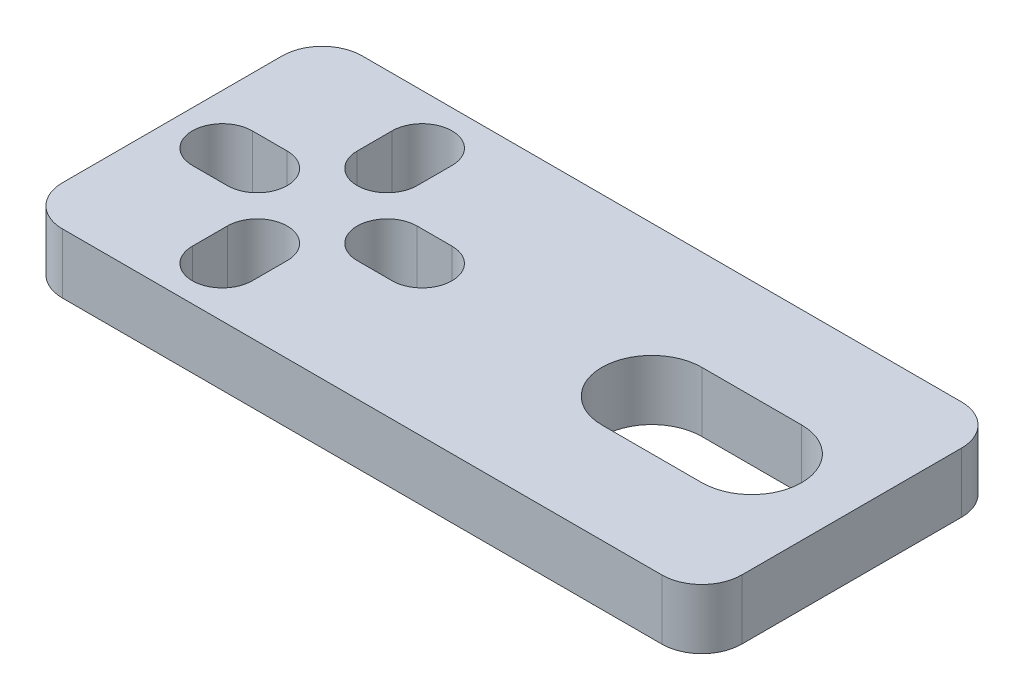
ISO-10303-21;
HEADER;
FILE_DESCRIPTION(('STEP AP214'),'2;1');
FILE_NAME('part.step','',(''),(''),'','','');
FILE_SCHEMA(('AUTOMOTIVE_DESIGN { 1 0 10303 214 1 1 1 1 }'));
ENDSEC;
DATA;
#1=APPLICATION_CONTEXT('core data for automotive mechanical design processes');
#2=APPLICATION_PROTOCOL_DEFINITION('international standard','automotive_design',2000,#1);
#3=PRODUCT_CONTEXT('',#1,'mechanical');
#4=PRODUCT('Part','Part','',(#3));
#5=PRODUCT_RELATED_PRODUCT_CATEGORY('part','',(#4));
#6=PRODUCT_DEFINITION_FORMATION('','',#4);
#7=PRODUCT_DEFINITION_CONTEXT('part definition',#1,'design');
#8=PRODUCT_DEFINITION('design','',#6,#7);
#9=PRODUCT_DEFINITION_SHAPE('','',#8);
#10=(LENGTH_UNIT() NAMED_UNIT(*) SI_UNIT(.MILLI.,.METRE.));
#11=(NAMED_UNIT(*) PLANE_ANGLE_UNIT() SI_UNIT($,.RADIAN.));
#12=(NAMED_UNIT(*) SI_UNIT($,.STERADIAN.) SOLID_ANGLE_UNIT());
#13=UNCERTAINTY_MEASURE_WITH_UNIT(LENGTH_MEASURE(1.E-05),#10,'distance_accuracy_value','');
#14=(GEOMETRIC_REPRESENTATION_CONTEXT(3) GLOBAL_UNCERTAINTY_ASSIGNED_CONTEXT((#13)) GLOBAL_UNIT_ASSIGNED_CONTEXT((#10,
#11,#12)) REPRESENTATION_CONTEXT('',''));
#15=CARTESIAN_POINT('',(0.,0.,0.));
#16=DIRECTION('',(0.,0.,1.));
#17=DIRECTION('',(1.,0.,0.));
#18=AXIS2_PLACEMENT_3D('',#15,#16,#17);
#19=CARTESIAN_POINT('',(12.5830679286446,4.74958475249559,4.66787542451857));
#20=DIRECTION('',(0.,-1.,0.));
#21=DIRECTION('',(0.,0.,-1.));
#22=AXIS2_PLACEMENT_3D('',#19,#20,#21);
#23=CYLINDRICAL_SURFACE('',#22,2.);
#24=CARTESIAN_POINT('',(12.5830679286446,1.74958475249559,4.66787542451857));
#25=DIRECTION('',(0.,1.,0.));
#26=DIRECTION('',(0.,0.,1.));
#27=AXIS2_PLACEMENT_3D('',#24,#25,#26);
#28=CIRCLE('',#27,2.);
#29=CARTESIAN_POINT('',(12.5830679286446,1.74958475249559,6.66787542451857));
#30=VERTEX_POINT('',#29);
#31=CARTESIAN_POINT('',(14.5830679286446,1.74958475249559,4.66787542451856));
#32=VERTEX_POINT('',#31);
#33=EDGE_CURVE('E358',#30,#32,#28,.T.);
#34=ORIENTED_EDGE('',*,*,#33,.T.);
#35=DIRECTION('',(0.,-1.,0.));
#36=VECTOR('',#35,1.);
#37=CARTESIAN_POINT('',(14.5830679286446,4.74958475249559,4.66787542451856));
#38=LINE('',#37,#36);
#39=CARTESIAN_POINT('',(14.5830679286446,4.74958475249559,4.66787542451856));
#40=VERTEX_POINT('',#39);
#41=EDGE_CURVE('E10',#40,#32,#38,.T.);
#42=ORIENTED_EDGE('',*,*,#41,.F.);
#43=CARTESIAN_POINT('',(12.5830679286446,4.74958475249559,4.66787542451857));
#44=DIRECTION('',(0.,1.,0.));
#45=DIRECTION('',(0.,0.,1.));
#46=AXIS2_PLACEMENT_3D('',#43,#44,#45);
#47=CIRCLE('',#46,2.);
#48=CARTESIAN_POINT('',(12.5830679286446,4.74958475249559,6.66787542451857));
#49=VERTEX_POINT('',#48);
#50=EDGE_CURVE('E365',#49,#40,#47,.T.);
#51=ORIENTED_EDGE('',*,*,#50,.F.);
#52=DIRECTION('',(0.,-1.,0.));
#53=VECTOR('',#52,1.);
#54=CARTESIAN_POINT('',(12.5830679286446,4.74958475249559,6.66787542451857));
#55=LINE('',#54,#53);
#56=EDGE_CURVE('E383',#49,#30,#55,.T.);
#57=ORIENTED_EDGE('',*,*,#56,.T.);
#58=EDGE_LOOP('',(#34,#42,#51,#57));
#59=FACE_BOUND('',#58,.T.);
#60=ADVANCED_FACE('F16',(#59),#23,.T.);
#61=CARTESIAN_POINT('',(14.5830679286446,4.74958475249559,-6.33212457548142));
#62=DIRECTION('',(-1.,0.,0.));
#63=DIRECTION('',(0.,0.,1.));
#64=AXIS2_PLACEMENT_3D('',#61,#62,#63);
#65=PLANE('',#64);
#66=DIRECTION('',(0.,0.,-1.));
#67=VECTOR('',#66,1.);
#68=CARTESIAN_POINT('',(14.5830679286446,1.74958475249559,-6.33212457548142));
#69=LINE('',#68,#67);
#70=CARTESIAN_POINT('',(14.5830679286446,1.74958475249559,-6.33212457548142));
#71=VERTEX_POINT('',#70);
#72=EDGE_CURVE('E386',#32,#71,#69,.T.);
#73=ORIENTED_EDGE('',*,*,#72,.T.);
#74=DIRECTION('',(0.,-1.,0.));
#75=VECTOR('',#74,1.);
#76=CARTESIAN_POINT('',(14.5830679286446,4.74958475249559,-6.33212457548142));
#77=LINE('',#76,#75);
#78=CARTESIAN_POINT('',(14.5830679286446,4.74958475249559,-6.33212457548142));
#79=VERTEX_POINT('',#78);
#80=EDGE_CURVE('E23',#79,#71,#77,.T.);
#81=ORIENTED_EDGE('',*,*,#80,.F.);
#82=DIRECTION('',(0.,0.,-1.));
#83=VECTOR('',#82,1.);
#84=CARTESIAN_POINT('',(14.5830679286446,4.74958475249559,-6.33212457548142));
#85=LINE('',#84,#83);
#86=EDGE_CURVE('E368',#40,#79,#85,.T.);
#87=ORIENTED_EDGE('',*,*,#86,.F.);
#88=ORIENTED_EDGE('',*,*,#41,.T.);
#89=EDGE_LOOP('',(#73,#81,#87,#88));
#90=FACE_BOUND('',#89,.T.);
#91=ADVANCED_FACE('F442',(#90),#65,.F.);
#92=CARTESIAN_POINT('',(12.5830679286446,4.74958475249559,-6.33212457548143));
#93=DIRECTION('',(0.,-1.,0.));
#94=DIRECTION('',(0.,0.,-1.));
#95=AXIS2_PLACEMENT_3D('',#92,#93,#94);
#96=CYLINDRICAL_SURFACE('',#95,2.);
#97=CARTESIAN_POINT('',(12.5830679286446,1.74958475249559,-6.33212457548143));
#98=DIRECTION('',(0.,1.,0.));
#99=DIRECTION('',(0.,0.,-1.));
#100=AXIS2_PLACEMENT_3D('',#97,#98,#99);
#101=CIRCLE('',#100,2.);
#102=CARTESIAN_POINT('',(12.5830679286446,1.74958475249559,-8.33212457548143));
#103=VERTEX_POINT('',#102);
#104=EDGE_CURVE('E388',#71,#103,#101,.T.);
#105=ORIENTED_EDGE('',*,*,#104,.T.);
#106=DIRECTION('',(0.,-1.,0.));
#107=VECTOR('',#106,1.);
#108=CARTESIAN_POINT('',(12.5830679286446,4.74958475249559,-8.33212457548143));
#109=LINE('',#108,#107);
#110=CARTESIAN_POINT('',(12.5830679286446,4.74958475249559,-8.33212457548143));
#111=VERTEX_POINT('',#110);
#112=EDGE_CURVE('E413',#111,#103,#109,.T.);
#113=ORIENTED_EDGE('',*,*,#112,.F.);
#114=CARTESIAN_POINT('',(12.5830679286446,4.74958475249559,-6.33212457548143));
#115=DIRECTION('',(0.,1.,0.));
#116=DIRECTION('',(0.,0.,-1.));
#117=AXIS2_PLACEMENT_3D('',#114,#115,#116);
#118=CIRCLE('',#117,2.);
#119=EDGE_CURVE('E371',#79,#111,#118,.T.);
#120=ORIENTED_EDGE('',*,*,#119,.F.);
#121=ORIENTED_EDGE('',*,*,#80,.T.);
#122=EDGE_LOOP('',(#105,#113,#120,#121));
#123=FACE_BOUND('',#122,.T.);
#124=ADVANCED_FACE('F420',(#123),#96,.T.);
#125=CARTESIAN_POINT('',(-17.4169320713554,4.74958475249559,-8.33212457548143));
#126=DIRECTION('',(0.,0.,1.));
#127=DIRECTION('',(1.,0.,0.));
#128=AXIS2_PLACEMENT_3D('',#125,#126,#127);
#129=PLANE('',#128);
#130=DIRECTION('',(-1.,0.,0.));
#131=VECTOR('',#130,1.);
#132=CARTESIAN_POINT('',(-17.4169320713554,1.74958475249559,-8.33212457548143));
#133=LINE('',#132,#131);
#134=CARTESIAN_POINT('',(-17.4169320713554,1.74958475249559,-8.33212457548143));
#135=VERTEX_POINT('',#134);
#136=EDGE_CURVE('E390',#103,#135,#133,.T.);
#137=ORIENTED_EDGE('',*,*,#136,.T.);
#138=DIRECTION('',(0.,-1.,0.));
#139=VECTOR('',#138,1.);
#140=CARTESIAN_POINT('',(-17.4169320713554,4.74958475249559,-8.33212457548143));
#141=LINE('',#140,#139);
#142=CARTESIAN_POINT('',(-17.4169320713554,4.74958475249559,-8.33212457548143));
#143=VERTEX_POINT('',#142);
#144=EDGE_CURVE('E410',#143,#135,#141,.T.);
#145=ORIENTED_EDGE('',*,*,#144,.F.);
#146=DIRECTION('',(-1.,0.,0.));
#147=VECTOR('',#146,1.);
#148=CARTESIAN_POINT('',(-17.4169320713554,4.74958475249559,-8.33212457548143));
#149=LINE('',#148,#147);
#150=EDGE_CURVE('E373',#111,#143,#149,.T.);
#151=ORIENTED_EDGE('',*,*,#150,.F.);
#152=ORIENTED_EDGE('',*,*,#112,.T.);
#153=EDGE_LOOP('',(#137,#145,#151,#152));
#154=FACE_BOUND('',#153,.T.);
#155=ADVANCED_FACE('F430',(#154),#129,.F.);
#156=CARTESIAN_POINT('',(-17.4169320713554,4.74958475249559,-6.33212457548143));
#157=DIRECTION('',(0.,-1.,0.));
#158=DIRECTION('',(0.,0.,-1.));
#159=AXIS2_PLACEMENT_3D('',#156,#157,#158);
#160=CYLINDRICAL_SURFACE('',#159,2.);
#161=CARTESIAN_POINT('',(-17.4169320713554,1.74958475249559,-6.33212457548143));
#162=DIRECTION('',(0.,1.,0.));
#163=DIRECTION('',(0.,0.,1.));
#164=AXIS2_PLACEMENT_3D('',#161,#162,#163);
#165=CIRCLE('',#164,2.);
#166=CARTESIAN_POINT('',(-19.4169320713554,1.74958475249559,-6.33212457548142));
#167=VERTEX_POINT('',#166);
#168=EDGE_CURVE('E392',#135,#167,#165,.T.);
#169=ORIENTED_EDGE('',*,*,#168,.T.);
#170=DIRECTION('',(0.,-1.,0.));
#171=VECTOR('',#170,1.);
#172=CARTESIAN_POINT('',(-19.4169320713554,4.74958475249559,-6.33212457548142));
#173=LINE('',#172,#171);
#174=CARTESIAN_POINT('',(-19.4169320713554,4.74958475249559,-6.33212457548142));
#175=VERTEX_POINT('',#174);
#176=EDGE_CURVE('E407',#175,#167,#173,.T.);
#177=ORIENTED_EDGE('',*,*,#176,.F.);
#178=CARTESIAN_POINT('',(-17.4169320713554,4.74958475249559,-6.33212457548143));
#179=DIRECTION('',(0.,1.,0.));
#180=DIRECTION('',(0.,0.,1.));
#181=AXIS2_PLACEMENT_3D('',#178,#179,#180);
#182=CIRCLE('',#181,2.);
#183=EDGE_CURVE('E375',#143,#175,#182,.T.);
#184=ORIENTED_EDGE('',*,*,#183,.F.);
#185=ORIENTED_EDGE('',*,*,#144,.T.);
#186=EDGE_LOOP('',(#169,#177,#184,#185));
#187=FACE_BOUND('',#186,.T.);
#188=ADVANCED_FACE('F434',(#187),#160,.T.);
#189=CARTESIAN_POINT('',(-19.4169320713554,4.74958475249559,-6.33212457548142));
#190=DIRECTION('',(1.,0.,0.));
#191=DIRECTION('',(0.,0.,-1.));
#192=AXIS2_PLACEMENT_3D('',#189,#190,#191);
#193=PLANE('',#192);
#194=DIRECTION('',(0.,0.,1.));
#195=VECTOR('',#194,1.);
#196=CARTESIAN_POINT('',(-19.4169320713554,1.74958475249559,-6.33212457548142));
#197=LINE('',#196,#195);
#198=CARTESIAN_POINT('',(-19.4169320713554,1.74958475249559,4.66787542451855));
#199=VERTEX_POINT('',#198);
#200=EDGE_CURVE('E394',#167,#199,#197,.T.);
#201=ORIENTED_EDGE('',*,*,#200,.T.);
#202=DIRECTION('',(0.,-1.,0.));
#203=VECTOR('',#202,1.);
#204=CARTESIAN_POINT('',(-19.4169320713554,4.74958475249559,4.66787542451855));
#205=LINE('',#204,#203);
#206=CARTESIAN_POINT('',(-19.4169320713554,4.74958475249559,4.66787542451855));
#207=VERTEX_POINT('',#206);
#208=EDGE_CURVE('E404',#207,#199,#205,.T.);
#209=ORIENTED_EDGE('',*,*,#208,.F.);
#210=DIRECTION('',(0.,0.,1.));
#211=VECTOR('',#210,1.);
#212=CARTESIAN_POINT('',(-19.4169320713554,4.74958475249559,-6.33212457548142));
#213=LINE('',#212,#211);
#214=EDGE_CURVE('E377',#175,#207,#213,.T.);
#215=ORIENTED_EDGE('',*,*,#214,.F.);
#216=ORIENTED_EDGE('',*,*,#176,.T.);
#217=EDGE_LOOP('',(#201,#209,#215,#216));
#218=FACE_BOUND('',#217,.T.);
#219=ADVANCED_FACE('F455',(#218),#193,.F.);
#220=CARTESIAN_POINT('',(-17.4169320713554,4.74958475249559,4.66787542451857));
#221=DIRECTION('',(0.,-1.,0.));
#222=DIRECTION('',(0.,0.,-1.));
#223=AXIS2_PLACEMENT_3D('',#220,#221,#222);
#224=CYLINDRICAL_SURFACE('',#223,2.);
#225=CARTESIAN_POINT('',(-17.4169320713554,1.74958475249559,4.66787542451857));
#226=DIRECTION('',(0.,1.,0.));
#227=DIRECTION('',(0.,0.,1.));
#228=AXIS2_PLACEMENT_3D('',#225,#226,#227);
#229=CIRCLE('',#228,2.);
#230=CARTESIAN_POINT('',(-17.4169320713554,1.74958475249559,6.66787542451857));
#231=VERTEX_POINT('',#230);
#232=EDGE_CURVE('E396',#199,#231,#229,.T.);
#233=ORIENTED_EDGE('',*,*,#232,.T.);
#234=DIRECTION('',(0.,-1.,0.));
#235=VECTOR('',#234,1.);
#236=CARTESIAN_POINT('',(-17.4169320713554,4.74958475249559,6.66787542451857));
#237=LINE('',#236,#235);
#238=CARTESIAN_POINT('',(-17.4169320713554,4.74958475249559,6.66787542451857));
#239=VERTEX_POINT('',#238);
#240=EDGE_CURVE('E401',#239,#231,#237,.T.);
#241=ORIENTED_EDGE('',*,*,#240,.F.);
#242=CARTESIAN_POINT('',(-17.4169320713554,4.74958475249559,4.66787542451857));
#243=DIRECTION('',(0.,1.,0.));
#244=DIRECTION('',(0.,0.,1.));
#245=AXIS2_PLACEMENT_3D('',#242,#243,#244);
#246=CIRCLE('',#245,2.);
#247=EDGE_CURVE('E379',#207,#239,#246,.T.);
#248=ORIENTED_EDGE('',*,*,#247,.F.);
#249=ORIENTED_EDGE('',*,*,#208,.T.);
#250=EDGE_LOOP('',(#233,#241,#248,#249));
#251=FACE_BOUND('',#250,.T.);
#252=ADVANCED_FACE('F453',(#251),#224,.T.);
#253=CARTESIAN_POINT('',(-17.4169320713554,4.74958475249559,6.66787542451857));
#254=DIRECTION('',(0.,0.,-1.));
#255=DIRECTION('',(-1.,0.,0.));
#256=AXIS2_PLACEMENT_3D('',#253,#254,#255);
#257=PLANE('',#256);
#258=DIRECTION('',(1.,0.,0.));
#259=VECTOR('',#258,1.);
#260=CARTESIAN_POINT('',(-17.4169320713554,1.74958475249559,6.66787542451857));
#261=LINE('',#260,#259);
#262=EDGE_CURVE('E369',#231,#30,#261,.T.);
#263=ORIENTED_EDGE('',*,*,#262,.T.);
#264=ORIENTED_EDGE('',*,*,#56,.F.);
#265=DIRECTION('',(1.,0.,0.));
#266=VECTOR('',#265,1.);
#267=CARTESIAN_POINT('',(-17.4169320713554,4.74958475249559,6.66787542451857));
#268=LINE('',#267,#266);
#269=EDGE_CURVE('E381',#239,#49,#268,.T.);
#270=ORIENTED_EDGE('',*,*,#269,.F.);
#271=ORIENTED_EDGE('',*,*,#240,.T.);
#272=EDGE_LOOP('',(#263,#264,#270,#271));
#273=FACE_BOUND('',#272,.T.);
#274=ADVANCED_FACE('F448',(#273),#257,.F.);
#275=CARTESIAN_POINT('',(12.5830679286446,4.74958475249559,4.66787542451857));
#276=DIRECTION('',(0.,1.,0.));
#277=DIRECTION('',(0.,0.,1.));
#278=AXIS2_PLACEMENT_3D('',#275,#276,#277);
#279=PLANE('',#278);
#280=CARTESIAN_POINT('',(-11.9169320713554,4.74958475249559,2.41787542451857));
#281=DIRECTION('',(0.,1.,0.));
#282=DIRECTION('',(0.,0.,1.));
#283=AXIS2_PLACEMENT_3D('',#280,#281,#282);
#284=CIRCLE('',#283,1.5);
#285=CARTESIAN_POINT('',(-10.4169320713554,4.74958475249559,2.41787542451857));
#286=VERTEX_POINT('',#285);
#287=CARTESIAN_POINT('',(-13.4169320713554,4.74958475249559,2.41787542451857));
#288=VERTEX_POINT('',#287);
#289=EDGE_CURVE('E30',#286,#288,#284,.T.);
#290=ORIENTED_EDGE('',*,*,#289,.F.);
#291=DIRECTION('',(0.,0.,-1.));
#292=VECTOR('',#291,1.);
#293=CARTESIAN_POINT('',(-10.4169320713554,4.74958475249559,2.41787542451857));
#294=LINE('',#293,#292);
#295=CARTESIAN_POINT('',(-10.4169320713554,4.74958475249559,4.16787542451857));
#296=VERTEX_POINT('',#295);
#297=EDGE_CURVE('E218',#296,#286,#294,.T.);
#298=ORIENTED_EDGE('',*,*,#297,.F.);
#299=CARTESIAN_POINT('',(-11.9169320713554,4.74958475249559,4.16787542451857));
#300=DIRECTION('',(0.,1.,0.));
#301=DIRECTION('',(0.,0.,1.));
#302=AXIS2_PLACEMENT_3D('',#299,#300,#301);
#303=CIRCLE('',#302,1.5);
#304=CARTESIAN_POINT('',(-13.4169320713554,4.74958475249559,4.16787542451857));
#305=VERTEX_POINT('',#304);
#306=EDGE_CURVE('E221',#305,#296,#303,.T.);
#307=ORIENTED_EDGE('',*,*,#306,.F.);
#308=DIRECTION('',(0.,0.,1.));
#309=VECTOR('',#308,1.);
#310=CARTESIAN_POINT('',(-13.4169320713554,4.74958475249559,2.41787542451857));
#311=LINE('',#310,#309);
#312=EDGE_CURVE('E227',#288,#305,#311,.T.);
#313=ORIENTED_EDGE('',*,*,#312,.F.);
#314=EDGE_LOOP('',(#290,#298,#307,#313));
#315=FACE_BOUND('',#314,.T.);
#316=CARTESIAN_POINT('',(-11.9169320713554,4.74958475249559,-5.83212457548143));
#317=DIRECTION('',(0.,1.,0.));
#318=DIRECTION('',(0.,0.,1.));
#319=AXIS2_PLACEMENT_3D('',#316,#317,#318);
#320=CIRCLE('',#319,1.5);
#321=CARTESIAN_POINT('',(-10.4169320713554,4.74958475249559,-5.83212457548143));
#322=VERTEX_POINT('',#321);
#323=CARTESIAN_POINT('',(-13.4169320713554,4.74958475249559,-5.83212457548143));
#324=VERTEX_POINT('',#323);
#325=EDGE_CURVE('E233',#322,#324,#320,.T.);
#326=ORIENTED_EDGE('',*,*,#325,.F.);
#327=DIRECTION('',(0.,0.,-1.));
#328=VECTOR('',#327,1.);
#329=CARTESIAN_POINT('',(-10.4169320713554,4.74958475249559,-5.83212457548143));
#330=LINE('',#329,#328);
#331=CARTESIAN_POINT('',(-10.4169320713554,4.74958475249559,-4.08212457548143));
#332=VERTEX_POINT('',#331);
#333=EDGE_CURVE('E241',#332,#322,#330,.T.);
#334=ORIENTED_EDGE('',*,*,#333,.F.);
#335=CARTESIAN_POINT('',(-11.9169320713554,4.74958475249559,-4.08212457548143));
#336=DIRECTION('',(0.,1.,0.));
#337=DIRECTION('',(0.,0.,1.));
#338=AXIS2_PLACEMENT_3D('',#335,#336,#337);
#339=CIRCLE('',#338,1.5);
#340=CARTESIAN_POINT('',(-13.4169320713554,4.74958475249559,-4.08212457548143));
#341=VERTEX_POINT('',#340);
#342=EDGE_CURVE('E255',#341,#332,#339,.T.);
#343=ORIENTED_EDGE('',*,*,#342,.F.);
#344=DIRECTION('',(0.,0.,1.));
#345=VECTOR('',#344,1.);
#346=CARTESIAN_POINT('',(-13.4169320713554,4.74958475249559,-5.83212457548143));
#347=LINE('',#346,#345);
#348=EDGE_CURVE('E252',#324,#341,#347,.T.);
#349=ORIENTED_EDGE('',*,*,#348,.F.);
#350=EDGE_LOOP('',(#326,#334,#343,#349));
#351=FACE_BOUND('',#350,.T.);
#352=CARTESIAN_POINT('',(-8.66693207135541,4.74958475249559,-0.83212457548143));
#353=DIRECTION('',(0.,1.,0.));
#354=DIRECTION('',(0.,0.,1.));
#355=AXIS2_PLACEMENT_3D('',#352,#353,#354);
#356=CIRCLE('',#355,1.5);
#357=CARTESIAN_POINT('',(-8.66693207135541,4.74958475249559,-2.33212457548143));
#358=VERTEX_POINT('',#357);
#359=CARTESIAN_POINT('',(-8.66693207135541,4.74958475249559,0.66787542451857));
#360=VERTEX_POINT('',#359);
#361=EDGE_CURVE('E262',#358,#360,#356,.T.);
#362=ORIENTED_EDGE('',*,*,#361,.F.);
#363=DIRECTION('',(-1.,0.,0.));
#364=VECTOR('',#363,1.);
#365=CARTESIAN_POINT('',(-8.66693207135541,4.74958475249559,-2.33212457548143));
#366=LINE('',#365,#364);
#367=CARTESIAN_POINT('',(-6.91693207135541,4.74958475249559,-2.33212457548143));
#368=VERTEX_POINT('',#367);
#369=EDGE_CURVE('E273',#368,#358,#366,.T.);
#370=ORIENTED_EDGE('',*,*,#369,.F.);
#371=CARTESIAN_POINT('',(-6.91693207135541,4.74958475249559,-0.83212457548143));
#372=DIRECTION('',(0.,1.,0.));
#373=DIRECTION('',(0.,0.,1.));
#374=AXIS2_PLACEMENT_3D('',#371,#372,#373);
#375=CIRCLE('',#374,1.5);
#376=CARTESIAN_POINT('',(-6.91693207135541,4.74958475249559,0.66787542451857));
#377=VERTEX_POINT('',#376);
#378=EDGE_CURVE('E287',#377,#368,#375,.T.);
#379=ORIENTED_EDGE('',*,*,#378,.F.);
#380=DIRECTION('',(1.,0.,0.));
#381=VECTOR('',#380,1.);
#382=CARTESIAN_POINT('',(-8.66693207135541,4.74958475249559,0.66787542451857));
#383=LINE('',#382,#381);
#384=EDGE_CURVE('E284',#360,#377,#383,.T.);
#385=ORIENTED_EDGE('',*,*,#384,.F.);
#386=EDGE_LOOP('',(#362,#370,#379,#385));
#387=FACE_BOUND('',#386,.T.);
#388=CARTESIAN_POINT('',(-16.9169320713554,4.74958475249559,-0.83212457548143));
#389=DIRECTION('',(0.,1.,0.));
#390=DIRECTION('',(0.,0.,1.));
#391=AXIS2_PLACEMENT_3D('',#388,#389,#390);
#392=CIRCLE('',#391,1.5);
#393=CARTESIAN_POINT('',(-16.9169320713554,4.74958475249559,-2.33212457548143));
#394=VERTEX_POINT('',#393);
#395=CARTESIAN_POINT('',(-16.9169320713554,4.74958475249559,0.66787542451857));
#396=VERTEX_POINT('',#395);
#397=EDGE_CURVE('E294',#394,#396,#392,.T.);
#398=ORIENTED_EDGE('',*,*,#397,.F.);
#399=DIRECTION('',(-1.,0.,0.));
#400=VECTOR('',#399,1.);
#401=CARTESIAN_POINT('',(-16.9169320713554,4.74958475249559,-2.33212457548143));
#402=LINE('',#401,#400);
#403=CARTESIAN_POINT('',(-15.1669320713554,4.74958475249559,-2.33212457548143));
#404=VERTEX_POINT('',#403);
#405=EDGE_CURVE('E305',#404,#394,#402,.T.);
#406=ORIENTED_EDGE('',*,*,#405,.F.);
#407=CARTESIAN_POINT('',(-15.1669320713554,4.74958475249559,-0.83212457548143));
#408=DIRECTION('',(0.,1.,0.));
#409=DIRECTION('',(0.,0.,1.));
#410=AXIS2_PLACEMENT_3D('',#407,#408,#409);
#411=CIRCLE('',#410,1.5);
#412=CARTESIAN_POINT('',(-15.1669320713554,4.74958475249559,0.66787542451857));
#413=VERTEX_POINT('',#412);
#414=EDGE_CURVE('E319',#413,#404,#411,.T.);
#415=ORIENTED_EDGE('',*,*,#414,.F.);
#416=DIRECTION('',(1.,0.,0.));
#417=VECTOR('',#416,1.);
#418=CARTESIAN_POINT('',(-16.9169320713554,4.74958475249559,0.66787542451857));
#419=LINE('',#418,#417);
#420=EDGE_CURVE('E316',#396,#413,#419,.T.);
#421=ORIENTED_EDGE('',*,*,#420,.F.);
#422=EDGE_LOOP('',(#398,#406,#415,#421));
#423=FACE_BOUND('',#422,.T.);
#424=CARTESIAN_POINT('',(4.5830679286446,4.74958475249559,-0.83212457548143));
#425=DIRECTION('',(0.,1.,0.));
#426=DIRECTION('',(0.,0.,1.));
#427=AXIS2_PLACEMENT_3D('',#424,#425,#426);
#428=CIRCLE('',#427,2.5);
#429=CARTESIAN_POINT('',(4.5830679286446,4.74958475249559,-3.33212457548143));
#430=VERTEX_POINT('',#429);
#431=CARTESIAN_POINT('',(4.5830679286446,4.74958475249559,1.66787542451857));
#432=VERTEX_POINT('',#431);
#433=EDGE_CURVE('E326',#430,#432,#428,.T.);
#434=ORIENTED_EDGE('',*,*,#433,.F.);
#435=DIRECTION('',(-1.,0.,0.));
#436=VECTOR('',#435,1.);
#437=CARTESIAN_POINT('',(4.5830679286446,4.74958475249559,-3.33212457548143));
#438=LINE('',#437,#436);
#439=CARTESIAN_POINT('',(9.5830679286446,4.74958475249559,-3.33212457548143));
#440=VERTEX_POINT('',#439);
#441=EDGE_CURVE('E337',#440,#430,#438,.T.);
#442=ORIENTED_EDGE('',*,*,#441,.F.);
#443=CARTESIAN_POINT('',(9.5830679286446,4.74958475249559,-0.83212457548143));
#444=DIRECTION('',(0.,1.,0.));
#445=DIRECTION('',(0.,0.,1.));
#446=AXIS2_PLACEMENT_3D('',#443,#444,#445);
#447=CIRCLE('',#446,2.5);
#448=CARTESIAN_POINT('',(9.5830679286446,4.74958475249559,1.66787542451857));
#449=VERTEX_POINT('',#448);
#450=EDGE_CURVE('E351',#449,#440,#447,.T.);
#451=ORIENTED_EDGE('',*,*,#450,.F.);
#452=DIRECTION('',(1.,0.,0.));
#453=VECTOR('',#452,1.);
#454=CARTESIAN_POINT('',(4.5830679286446,4.74958475249559,1.66787542451857));
#455=LINE('',#454,#453);
#456=EDGE_CURVE('E348',#432,#449,#455,.T.);
#457=ORIENTED_EDGE('',*,*,#456,.F.);
#458=EDGE_LOOP('',(#434,#442,#451,#457));
#459=FACE_BOUND('',#458,.T.);
#460=ORIENTED_EDGE('',*,*,#50,.T.);
#461=ORIENTED_EDGE('',*,*,#86,.T.);
#462=ORIENTED_EDGE('',*,*,#119,.T.);
#463=ORIENTED_EDGE('',*,*,#150,.T.);
#464=ORIENTED_EDGE('',*,*,#183,.T.);
#465=ORIENTED_EDGE('',*,*,#214,.T.);
#466=ORIENTED_EDGE('',*,*,#247,.T.);
#467=ORIENTED_EDGE('',*,*,#269,.T.);
#468=EDGE_LOOP('',(#460,#461,#462,#463,#464,#465,#466,#467));
#469=FACE_BOUND('',#468,.T.);
#470=ADVANCED_FACE('F438',(#315,#351,#387,#423,#459,#469),#279,.T.);
#471=CARTESIAN_POINT('',(12.5830679286446,1.74958475249559,4.66787542451857));
#472=DIRECTION('',(0.,1.,0.));
#473=DIRECTION('',(0.,0.,1.));
#474=AXIS2_PLACEMENT_3D('',#471,#472,#473);
#475=PLANE('',#474);
#476=DIRECTION('',(0.,0.,-1.));
#477=VECTOR('',#476,1.);
#478=CARTESIAN_POINT('',(-10.4169320713554,1.74958475249559,2.41787542451857));
#479=LINE('',#478,#477);
#480=CARTESIAN_POINT('',(-10.4169320713554,1.74958475249559,4.16787542451857));
#481=VERTEX_POINT('',#480);
#482=CARTESIAN_POINT('',(-10.4169320713554,1.74958475249559,2.41787542451857));
#483=VERTEX_POINT('',#482);
#484=EDGE_CURVE('E208',#481,#483,#479,.T.);
#485=ORIENTED_EDGE('',*,*,#484,.T.);
#486=CARTESIAN_POINT('',(-11.9169320713554,1.74958475249559,2.41787542451857));
#487=DIRECTION('',(0.,1.,0.));
#488=DIRECTION('',(0.,0.,1.));
#489=AXIS2_PLACEMENT_3D('',#486,#487,#488);
#490=CIRCLE('',#489,1.5);
#491=CARTESIAN_POINT('',(-13.4169320713554,1.74958475249559,2.41787542451857));
#492=VERTEX_POINT('',#491);
#493=EDGE_CURVE('E202',#483,#492,#490,.T.);
#494=ORIENTED_EDGE('',*,*,#493,.T.);
#495=DIRECTION('',(0.,0.,1.));
#496=VECTOR('',#495,1.);
#497=CARTESIAN_POINT('',(-13.4169320713554,1.74958475249559,2.41787542451857));
#498=LINE('',#497,#496);
#499=CARTESIAN_POINT('',(-13.4169320713554,1.74958475249559,4.16787542451857));
#500=VERTEX_POINT('',#499);
#501=EDGE_CURVE('E211',#492,#500,#498,.T.);
#502=ORIENTED_EDGE('',*,*,#501,.T.);
#503=CARTESIAN_POINT('',(-11.9169320713554,1.74958475249559,4.16787542451857));
#504=DIRECTION('',(0.,1.,0.));
#505=DIRECTION('',(0.,0.,1.));
#506=AXIS2_PLACEMENT_3D('',#503,#504,#505);
#507=CIRCLE('',#506,1.5);
#508=EDGE_CURVE('E38',#500,#481,#507,.T.);
#509=ORIENTED_EDGE('',*,*,#508,.T.);
#510=EDGE_LOOP('',(#485,#494,#502,#509));
#511=FACE_BOUND('',#510,.T.);
#512=DIRECTION('',(0.,0.,-1.));
#513=VECTOR('',#512,1.);
#514=CARTESIAN_POINT('',(-10.4169320713554,1.74958475249559,-5.83212457548143));
#515=LINE('',#514,#513);
#516=CARTESIAN_POINT('',(-10.4169320713554,1.74958475249559,-4.08212457548143));
#517=VERTEX_POINT('',#516);
#518=CARTESIAN_POINT('',(-10.4169320713554,1.74958475249559,-5.83212457548143));
#519=VERTEX_POINT('',#518);
#520=EDGE_CURVE('E247',#517,#519,#515,.T.);
#521=ORIENTED_EDGE('',*,*,#520,.T.);
#522=CARTESIAN_POINT('',(-11.9169320713554,1.74958475249559,-5.83212457548143));
#523=DIRECTION('',(0.,1.,0.));
#524=DIRECTION('',(0.,0.,1.));
#525=AXIS2_PLACEMENT_3D('',#522,#523,#524);
#526=CIRCLE('',#525,1.5);
#527=CARTESIAN_POINT('',(-13.4169320713554,1.74958475249559,-5.83212457548143));
#528=VERTEX_POINT('',#527);
#529=EDGE_CURVE('E237',#519,#528,#526,.T.);
#530=ORIENTED_EDGE('',*,*,#529,.T.);
#531=DIRECTION('',(0.,0.,1.));
#532=VECTOR('',#531,1.);
#533=CARTESIAN_POINT('',(-13.4169320713554,1.74958475249559,-5.83212457548143));
#534=LINE('',#533,#532);
#535=CARTESIAN_POINT('',(-13.4169320713554,1.74958475249559,-4.08212457548143));
#536=VERTEX_POINT('',#535);
#537=EDGE_CURVE('E240',#528,#536,#534,.T.);
#538=ORIENTED_EDGE('',*,*,#537,.T.);
#539=CARTESIAN_POINT('',(-11.9169320713554,1.74958475249559,-4.08212457548143));
#540=DIRECTION('',(0.,1.,0.));
#541=DIRECTION('',(0.,0.,1.));
#542=AXIS2_PLACEMENT_3D('',#539,#540,#541);
#543=CIRCLE('',#542,1.5);
#544=EDGE_CURVE('E244',#536,#517,#543,.T.);
#545=ORIENTED_EDGE('',*,*,#544,.T.);
#546=EDGE_LOOP('',(#521,#530,#538,#545));
#547=FACE_BOUND('',#546,.T.);
#548=DIRECTION('',(-1.,0.,0.));
#549=VECTOR('',#548,1.);
#550=CARTESIAN_POINT('',(-8.66693207135541,1.74958475249559,-2.33212457548143));
#551=LINE('',#550,#549);
#552=CARTESIAN_POINT('',(-6.91693207135541,1.74958475249559,-2.33212457548143));
#553=VERTEX_POINT('',#552);
#554=CARTESIAN_POINT('',(-8.66693207135541,1.74958475249559,-2.33212457548143));
#555=VERTEX_POINT('',#554);
#556=EDGE_CURVE('E279',#553,#555,#551,.T.);
#557=ORIENTED_EDGE('',*,*,#556,.T.);
#558=CARTESIAN_POINT('',(-8.66693207135541,1.74958475249559,-0.83212457548143));
#559=DIRECTION('',(0.,1.,0.));
#560=DIRECTION('',(0.,0.,1.));
#561=AXIS2_PLACEMENT_3D('',#558,#559,#560);
#562=CIRCLE('',#561,1.5);
#563=CARTESIAN_POINT('',(-8.66693207135541,1.74958475249559,0.66787542451857));
#564=VERTEX_POINT('',#563);
#565=EDGE_CURVE('E269',#555,#564,#562,.T.);
#566=ORIENTED_EDGE('',*,*,#565,.T.);
#567=DIRECTION('',(1.,0.,0.));
#568=VECTOR('',#567,1.);
#569=CARTESIAN_POINT('',(-8.66693207135541,1.74958475249559,0.66787542451857));
#570=LINE('',#569,#568);
#571=CARTESIAN_POINT('',(-6.91693207135541,1.74958475249559,0.66787542451857));
#572=VERTEX_POINT('',#571);
#573=EDGE_CURVE('E272',#564,#572,#570,.T.);
#574=ORIENTED_EDGE('',*,*,#573,.T.);
#575=CARTESIAN_POINT('',(-6.91693207135541,1.74958475249559,-0.83212457548143));
#576=DIRECTION('',(0.,1.,0.));
#577=DIRECTION('',(0.,0.,1.));
#578=AXIS2_PLACEMENT_3D('',#575,#576,#577);
#579=CIRCLE('',#578,1.5);
#580=EDGE_CURVE('E276',#572,#553,#579,.T.);
#581=ORIENTED_EDGE('',*,*,#580,.T.);
#582=EDGE_LOOP('',(#557,#566,#574,#581));
#583=FACE_BOUND('',#582,.T.);
#584=DIRECTION('',(-1.,0.,0.));
#585=VECTOR('',#584,1.);
#586=CARTESIAN_POINT('',(-16.9169320713554,1.74958475249559,-2.33212457548143));
#587=LINE('',#586,#585);
#588=CARTESIAN_POINT('',(-15.1669320713554,1.74958475249559,-2.33212457548143));
#589=VERTEX_POINT('',#588);
#590=CARTESIAN_POINT('',(-16.9169320713554,1.74958475249559,-2.33212457548143));
#591=VERTEX_POINT('',#590);
#592=EDGE_CURVE('E311',#589,#591,#587,.T.);
#593=ORIENTED_EDGE('',*,*,#592,.T.);
#594=CARTESIAN_POINT('',(-16.9169320713554,1.74958475249559,-0.83212457548143));
#595=DIRECTION('',(0.,1.,0.));
#596=DIRECTION('',(0.,0.,1.));
#597=AXIS2_PLACEMENT_3D('',#594,#595,#596);
#598=CIRCLE('',#597,1.5);
#599=CARTESIAN_POINT('',(-16.9169320713554,1.74958475249559,0.66787542451857));
#600=VERTEX_POINT('',#599);
#601=EDGE_CURVE('E301',#591,#600,#598,.T.);
#602=ORIENTED_EDGE('',*,*,#601,.T.);
#603=DIRECTION('',(1.,0.,0.));
#604=VECTOR('',#603,1.);
#605=CARTESIAN_POINT('',(-16.9169320713554,1.74958475249559,0.66787542451857));
#606=LINE('',#605,#604);
#607=CARTESIAN_POINT('',(-15.1669320713554,1.74958475249559,0.66787542451857));
#608=VERTEX_POINT('',#607);
#609=EDGE_CURVE('E304',#600,#608,#606,.T.);
#610=ORIENTED_EDGE('',*,*,#609,.T.);
#611=CARTESIAN_POINT('',(-15.1669320713554,1.74958475249559,-0.83212457548143));
#612=DIRECTION('',(0.,1.,0.));
#613=DIRECTION('',(0.,0.,1.));
#614=AXIS2_PLACEMENT_3D('',#611,#612,#613);
#615=CIRCLE('',#614,1.5);
#616=EDGE_CURVE('E308',#608,#589,#615,.T.);
#617=ORIENTED_EDGE('',*,*,#616,.T.);
#618=EDGE_LOOP('',(#593,#602,#610,#617));
#619=FACE_BOUND('',#618,.T.);
#620=DIRECTION('',(-1.,0.,0.));
#621=VECTOR('',#620,1.);
#622=CARTESIAN_POINT('',(4.5830679286446,1.74958475249559,-3.33212457548143));
#623=LINE('',#622,#621);
#624=CARTESIAN_POINT('',(9.5830679286446,1.74958475249559,-3.33212457548143));
#625=VERTEX_POINT('',#624);
#626=CARTESIAN_POINT('',(4.5830679286446,1.74958475249559,-3.33212457548143));
#627=VERTEX_POINT('',#626);
#628=EDGE_CURVE('E343',#625,#627,#623,.T.);
#629=ORIENTED_EDGE('',*,*,#628,.T.);
#630=CARTESIAN_POINT('',(4.5830679286446,1.74958475249559,-0.83212457548143));
#631=DIRECTION('',(0.,1.,0.));
#632=DIRECTION('',(0.,0.,1.));
#633=AXIS2_PLACEMENT_3D('',#630,#631,#632);
#634=CIRCLE('',#633,2.5);
#635=CARTESIAN_POINT('',(4.5830679286446,1.74958475249559,1.66787542451857));
#636=VERTEX_POINT('',#635);
#637=EDGE_CURVE('E333',#627,#636,#634,.T.);
#638=ORIENTED_EDGE('',*,*,#637,.T.);
#639=DIRECTION('',(1.,0.,0.));
#640=VECTOR('',#639,1.);
#641=CARTESIAN_POINT('',(4.5830679286446,1.74958475249559,1.66787542451857));
#642=LINE('',#641,#640);
#643=CARTESIAN_POINT('',(9.5830679286446,1.74958475249559,1.66787542451857));
#644=VERTEX_POINT('',#643);
#645=EDGE_CURVE('E336',#636,#644,#642,.T.);
#646=ORIENTED_EDGE('',*,*,#645,.T.);
#647=CARTESIAN_POINT('',(9.5830679286446,1.74958475249559,-0.83212457548143));
#648=DIRECTION('',(0.,1.,0.));
#649=DIRECTION('',(0.,0.,1.));
#650=AXIS2_PLACEMENT_3D('',#647,#648,#649);
#651=CIRCLE('',#650,2.5);
#652=EDGE_CURVE('E340',#644,#625,#651,.T.);
#653=ORIENTED_EDGE('',*,*,#652,.T.);
#654=EDGE_LOOP('',(#629,#638,#646,#653));
#655=FACE_BOUND('',#654,.T.);
#656=ORIENTED_EDGE('',*,*,#33,.F.);
#657=ORIENTED_EDGE('',*,*,#262,.F.);
#658=ORIENTED_EDGE('',*,*,#232,.F.);
#659=ORIENTED_EDGE('',*,*,#200,.F.);
#660=ORIENTED_EDGE('',*,*,#168,.F.);
#661=ORIENTED_EDGE('',*,*,#136,.F.);
#662=ORIENTED_EDGE('',*,*,#104,.F.);
#663=ORIENTED_EDGE('',*,*,#72,.F.);
#664=EDGE_LOOP('',(#656,#657,#658,#659,#660,#661,#662,#663));
#665=FACE_BOUND('',#664,.T.);
#666=ADVANCED_FACE('F215',(#511,#547,#583,#619,#655,#665),#475,.F.);
#667=CARTESIAN_POINT('',(4.5830679286446,1.74958475249559,-0.83212457548143));
#668=DIRECTION('',(0.,1.,0.));
#669=DIRECTION('',(0.,0.,1.));
#670=AXIS2_PLACEMENT_3D('',#667,#668,#669);
#671=CYLINDRICAL_SURFACE('',#670,2.5);
#672=ORIENTED_EDGE('',*,*,#433,.T.);
#673=DIRECTION('',(0.,1.,0.));
#674=VECTOR('',#673,1.);
#675=CARTESIAN_POINT('',(4.5830679286446,1.74958475249559,1.66787542451857));
#676=LINE('',#675,#674);
#677=EDGE_CURVE('E346',#636,#432,#676,.T.);
#678=ORIENTED_EDGE('',*,*,#677,.F.);
#679=ORIENTED_EDGE('',*,*,#637,.F.);
#680=DIRECTION('',(0.,1.,0.));
#681=VECTOR('',#680,1.);
#682=CARTESIAN_POINT('',(4.5830679286446,1.74958475249559,-3.33212457548143));
#683=LINE('',#682,#681);
#684=EDGE_CURVE('E356',#627,#430,#683,.T.);
#685=ORIENTED_EDGE('',*,*,#684,.T.);
#686=EDGE_LOOP('',(#672,#678,#679,#685));
#687=FACE_BOUND('',#686,.T.);
#688=ADVANCED_FACE('F524',(#687),#671,.F.);
#689=CARTESIAN_POINT('',(4.5830679286446,1.74958475249559,-3.33212457548143));
#690=DIRECTION('',(0.,0.,-1.));
#691=DIRECTION('',(-1.,0.,0.));
#692=AXIS2_PLACEMENT_3D('',#689,#690,#691);
#693=PLANE('',#692);
#694=ORIENTED_EDGE('',*,*,#441,.T.);
#695=ORIENTED_EDGE('',*,*,#684,.F.);
#696=ORIENTED_EDGE('',*,*,#628,.F.);
#697=DIRECTION('',(0.,1.,0.));
#698=VECTOR('',#697,1.);
#699=CARTESIAN_POINT('',(9.5830679286446,1.74958475249559,-3.33212457548143));
#700=LINE('',#699,#698);
#701=EDGE_CURVE('E359',#625,#440,#700,.T.);
#702=ORIENTED_EDGE('',*,*,#701,.T.);
#703=EDGE_LOOP('',(#694,#695,#696,#702));
#704=FACE_BOUND('',#703,.T.);
#705=ADVANCED_FACE('F533',(#704),#693,.F.);
#706=CARTESIAN_POINT('',(9.5830679286446,1.74958475249559,-0.83212457548143));
#707=DIRECTION('',(0.,1.,0.));
#708=DIRECTION('',(0.,0.,1.));
#709=AXIS2_PLACEMENT_3D('',#706,#707,#708);
#710=CYLINDRICAL_SURFACE('',#709,2.5);
#711=ORIENTED_EDGE('',*,*,#450,.T.);
#712=ORIENTED_EDGE('',*,*,#701,.F.);
#713=ORIENTED_EDGE('',*,*,#652,.F.);
#714=DIRECTION('',(0.,1.,0.));
#715=VECTOR('',#714,1.);
#716=CARTESIAN_POINT('',(9.5830679286446,1.74958475249559,1.66787542451857));
#717=LINE('',#716,#715);
#718=EDGE_CURVE('E361',#644,#449,#717,.T.);
#719=ORIENTED_EDGE('',*,*,#718,.T.);
#720=EDGE_LOOP('',(#711,#712,#713,#719));
#721=FACE_BOUND('',#720,.T.);
#722=ADVANCED_FACE('F543',(#721),#710,.F.);
#723=CARTESIAN_POINT('',(4.5830679286446,1.74958475249559,1.66787542451857));
#724=DIRECTION('',(0.,0.,1.));
#725=DIRECTION('',(1.,0.,0.));
#726=AXIS2_PLACEMENT_3D('',#723,#724,#725);
#727=PLANE('',#726);
#728=ORIENTED_EDGE('',*,*,#456,.T.);
#729=ORIENTED_EDGE('',*,*,#718,.F.);
#730=ORIENTED_EDGE('',*,*,#645,.F.);
#731=ORIENTED_EDGE('',*,*,#677,.T.);
#732=EDGE_LOOP('',(#728,#729,#730,#731));
#733=FACE_BOUND('',#732,.T.);
#734=ADVANCED_FACE('F553',(#733),#727,.F.);
#735=CARTESIAN_POINT('',(-16.9169320713554,1.74958475249559,-0.83212457548143));
#736=DIRECTION('',(0.,1.,0.));
#737=DIRECTION('',(0.,0.,1.));
#738=AXIS2_PLACEMENT_3D('',#735,#736,#737);
#739=CYLINDRICAL_SURFACE('',#738,1.5);
#740=ORIENTED_EDGE('',*,*,#397,.T.);
#741=DIRECTION('',(0.,1.,0.));
#742=VECTOR('',#741,1.);
#743=CARTESIAN_POINT('',(-16.9169320713554,1.74958475249559,0.66787542451857));
#744=LINE('',#743,#742);
#745=EDGE_CURVE('E314',#600,#396,#744,.T.);
#746=ORIENTED_EDGE('',*,*,#745,.F.);
#747=ORIENTED_EDGE('',*,*,#601,.F.);
#748=DIRECTION('',(0.,1.,0.));
#749=VECTOR('',#748,1.);
#750=CARTESIAN_POINT('',(-16.9169320713554,1.74958475249559,-2.33212457548143));
#751=LINE('',#750,#749);
#752=EDGE_CURVE('E324',#591,#394,#751,.T.);
#753=ORIENTED_EDGE('',*,*,#752,.T.);
#754=EDGE_LOOP('',(#740,#746,#747,#753));
#755=FACE_BOUND('',#754,.T.);
#756=ADVANCED_FACE('F563',(#755),#739,.F.);
#757=CARTESIAN_POINT('',(-16.9169320713554,1.74958475249559,-2.33212457548143));
#758=DIRECTION('',(0.,0.,-1.));
#759=DIRECTION('',(-1.,0.,0.));
#760=AXIS2_PLACEMENT_3D('',#757,#758,#759);
#761=PLANE('',#760);
#762=ORIENTED_EDGE('',*,*,#405,.T.);
#763=ORIENTED_EDGE('',*,*,#752,.F.);
#764=ORIENTED_EDGE('',*,*,#592,.F.);
#765=DIRECTION('',(0.,1.,0.));
#766=VECTOR('',#765,1.);
#767=CARTESIAN_POINT('',(-15.1669320713554,1.74958475249559,-2.33212457548143));
#768=LINE('',#767,#766);
#769=EDGE_CURVE('E327',#589,#404,#768,.T.);
#770=ORIENTED_EDGE('',*,*,#769,.T.);
#771=EDGE_LOOP('',(#762,#763,#764,#770));
#772=FACE_BOUND('',#771,.T.);
#773=ADVANCED_FACE('F573',(#772),#761,.F.);
#774=CARTESIAN_POINT('',(-15.1669320713554,1.74958475249559,-0.83212457548143));
#775=DIRECTION('',(0.,1.,0.));
#776=DIRECTION('',(0.,0.,1.));
#777=AXIS2_PLACEMENT_3D('',#774,#775,#776);
#778=CYLINDRICAL_SURFACE('',#777,1.5);
#779=ORIENTED_EDGE('',*,*,#414,.T.);
#780=ORIENTED_EDGE('',*,*,#769,.F.);
#781=ORIENTED_EDGE('',*,*,#616,.F.);
#782=DIRECTION('',(0.,1.,0.));
#783=VECTOR('',#782,1.);
#784=CARTESIAN_POINT('',(-15.1669320713554,1.74958475249559,0.66787542451857));
#785=LINE('',#784,#783);
#786=EDGE_CURVE('E329',#608,#413,#785,.T.);
#787=ORIENTED_EDGE('',*,*,#786,.T.);
#788=EDGE_LOOP('',(#779,#780,#781,#787));
#789=FACE_BOUND('',#788,.T.);
#790=ADVANCED_FACE('F583',(#789),#778,.F.);
#791=CARTESIAN_POINT('',(-16.9169320713554,1.74958475249559,0.66787542451857));
#792=DIRECTION('',(0.,0.,1.));
#793=DIRECTION('',(1.,0.,0.));
#794=AXIS2_PLACEMENT_3D('',#791,#792,#793);
#795=PLANE('',#794);
#796=ORIENTED_EDGE('',*,*,#420,.T.);
#797=ORIENTED_EDGE('',*,*,#786,.F.);
#798=ORIENTED_EDGE('',*,*,#609,.F.);
#799=ORIENTED_EDGE('',*,*,#745,.T.);
#800=EDGE_LOOP('',(#796,#797,#798,#799));
#801=FACE_BOUND('',#800,.T.);
#802=ADVANCED_FACE('F593',(#801),#795,.F.);
#803=CARTESIAN_POINT('',(-8.66693207135541,1.74958475249559,-0.83212457548143));
#804=DIRECTION('',(0.,1.,0.));
#805=DIRECTION('',(0.,0.,1.));
#806=AXIS2_PLACEMENT_3D('',#803,#804,#805);
#807=CYLINDRICAL_SURFACE('',#806,1.5);
#808=ORIENTED_EDGE('',*,*,#361,.T.);
#809=DIRECTION('',(0.,1.,0.));
#810=VECTOR('',#809,1.);
#811=CARTESIAN_POINT('',(-8.66693207135541,1.74958475249559,0.66787542451857));
#812=LINE('',#811,#810);
#813=EDGE_CURVE('E282',#564,#360,#812,.T.);
#814=ORIENTED_EDGE('',*,*,#813,.F.);
#815=ORIENTED_EDGE('',*,*,#565,.F.);
#816=DIRECTION('',(0.,1.,0.));
#817=VECTOR('',#816,1.);
#818=CARTESIAN_POINT('',(-8.66693207135541,1.74958475249559,-2.33212457548143));
#819=LINE('',#818,#817);
#820=EDGE_CURVE('E292',#555,#358,#819,.T.);
#821=ORIENTED_EDGE('',*,*,#820,.T.);
#822=EDGE_LOOP('',(#808,#814,#815,#821));
#823=FACE_BOUND('',#822,.T.);
#824=ADVANCED_FACE('F603',(#823),#807,.F.);
#825=CARTESIAN_POINT('',(-8.66693207135541,1.74958475249559,-2.33212457548143));
#826=DIRECTION('',(0.,0.,-1.));
#827=DIRECTION('',(-1.,0.,0.));
#828=AXIS2_PLACEMENT_3D('',#825,#826,#827);
#829=PLANE('',#828);
#830=ORIENTED_EDGE('',*,*,#369,.T.);
#831=ORIENTED_EDGE('',*,*,#820,.F.);
#832=ORIENTED_EDGE('',*,*,#556,.F.);
#833=DIRECTION('',(0.,1.,0.));
#834=VECTOR('',#833,1.);
#835=CARTESIAN_POINT('',(-6.91693207135541,1.74958475249559,-2.33212457548143));
#836=LINE('',#835,#834);
#837=EDGE_CURVE('E295',#553,#368,#836,.T.);
#838=ORIENTED_EDGE('',*,*,#837,.T.);
#839=EDGE_LOOP('',(#830,#831,#832,#838));
#840=FACE_BOUND('',#839,.T.);
#841=ADVANCED_FACE('F613',(#840),#829,.F.);
#842=CARTESIAN_POINT('',(-6.91693207135541,1.74958475249559,-0.83212457548143));
#843=DIRECTION('',(0.,1.,0.));
#844=DIRECTION('',(0.,0.,1.));
#845=AXIS2_PLACEMENT_3D('',#842,#843,#844);
#846=CYLINDRICAL_SURFACE('',#845,1.5);
#847=ORIENTED_EDGE('',*,*,#378,.T.);
#848=ORIENTED_EDGE('',*,*,#837,.F.);
#849=ORIENTED_EDGE('',*,*,#580,.F.);
#850=DIRECTION('',(0.,1.,0.));
#851=VECTOR('',#850,1.);
#852=CARTESIAN_POINT('',(-6.91693207135541,1.74958475249559,0.66787542451857));
#853=LINE('',#852,#851);
#854=EDGE_CURVE('E297',#572,#377,#853,.T.);
#855=ORIENTED_EDGE('',*,*,#854,.T.);
#856=EDGE_LOOP('',(#847,#848,#849,#855));
#857=FACE_BOUND('',#856,.T.);
#858=ADVANCED_FACE('F623',(#857),#846,.F.);
#859=CARTESIAN_POINT('',(-8.66693207135541,1.74958475249559,0.66787542451857));
#860=DIRECTION('',(0.,0.,1.));
#861=DIRECTION('',(1.,0.,0.));
#862=AXIS2_PLACEMENT_3D('',#859,#860,#861);
#863=PLANE('',#862);
#864=ORIENTED_EDGE('',*,*,#384,.T.);
#865=ORIENTED_EDGE('',*,*,#854,.F.);
#866=ORIENTED_EDGE('',*,*,#573,.F.);
#867=ORIENTED_EDGE('',*,*,#813,.T.);
#868=EDGE_LOOP('',(#864,#865,#866,#867));
#869=FACE_BOUND('',#868,.T.);
#870=ADVANCED_FACE('F633',(#869),#863,.F.);
#871=CARTESIAN_POINT('',(-11.9169320713554,1.74958475249559,-5.83212457548143));
#872=DIRECTION('',(0.,1.,0.));
#873=DIRECTION('',(0.,0.,1.));
#874=AXIS2_PLACEMENT_3D('',#871,#872,#873);
#875=CYLINDRICAL_SURFACE('',#874,1.5);
#876=ORIENTED_EDGE('',*,*,#325,.T.);
#877=DIRECTION('',(0.,1.,0.));
#878=VECTOR('',#877,1.);
#879=CARTESIAN_POINT('',(-13.4169320713554,1.74958475249559,-5.83212457548143));
#880=LINE('',#879,#878);
#881=EDGE_CURVE('E250',#528,#324,#880,.T.);
#882=ORIENTED_EDGE('',*,*,#881,.F.);
#883=ORIENTED_EDGE('',*,*,#529,.F.);
#884=DIRECTION('',(0.,1.,0.));
#885=VECTOR('',#884,1.);
#886=CARTESIAN_POINT('',(-10.4169320713554,1.74958475249559,-5.83212457548143));
#887=LINE('',#886,#885);
#888=EDGE_CURVE('E260',#519,#322,#887,.T.);
#889=ORIENTED_EDGE('',*,*,#888,.T.);
#890=EDGE_LOOP('',(#876,#882,#883,#889));
#891=FACE_BOUND('',#890,.T.);
#892=ADVANCED_FACE('F643',(#891),#875,.F.);
#893=CARTESIAN_POINT('',(-10.4169320713554,1.74958475249559,-5.83212457548143));
#894=DIRECTION('',(1.,0.,0.));
#895=DIRECTION('',(0.,0.,-1.));
#896=AXIS2_PLACEMENT_3D('',#893,#894,#895);
#897=PLANE('',#896);
#898=ORIENTED_EDGE('',*,*,#333,.T.);
#899=ORIENTED_EDGE('',*,*,#888,.F.);
#900=ORIENTED_EDGE('',*,*,#520,.F.);
#901=DIRECTION('',(0.,1.,0.));
#902=VECTOR('',#901,1.);
#903=CARTESIAN_POINT('',(-10.4169320713554,1.74958475249559,-4.08212457548143));
#904=LINE('',#903,#902);
#905=EDGE_CURVE('E263',#517,#332,#904,.T.);
#906=ORIENTED_EDGE('',*,*,#905,.T.);
#907=EDGE_LOOP('',(#898,#899,#900,#906));
#908=FACE_BOUND('',#907,.T.);
#909=ADVANCED_FACE('F653',(#908),#897,.F.);
#910=CARTESIAN_POINT('',(-11.9169320713554,1.74958475249559,-4.08212457548143));
#911=DIRECTION('',(0.,1.,0.));
#912=DIRECTION('',(0.,0.,1.));
#913=AXIS2_PLACEMENT_3D('',#910,#911,#912);
#914=CYLINDRICAL_SURFACE('',#913,1.5);
#915=ORIENTED_EDGE('',*,*,#342,.T.);
#916=ORIENTED_EDGE('',*,*,#905,.F.);
#917=ORIENTED_EDGE('',*,*,#544,.F.);
#918=DIRECTION('',(0.,1.,0.));
#919=VECTOR('',#918,1.);
#920=CARTESIAN_POINT('',(-13.4169320713554,1.74958475249559,-4.08212457548143));
#921=LINE('',#920,#919);
#922=EDGE_CURVE('E265',#536,#341,#921,.T.);
#923=ORIENTED_EDGE('',*,*,#922,.T.);
#924=EDGE_LOOP('',(#915,#916,#917,#923));
#925=FACE_BOUND('',#924,.T.);
#926=ADVANCED_FACE('F663',(#925),#914,.F.);
#927=CARTESIAN_POINT('',(-13.4169320713554,1.74958475249559,-5.83212457548143));
#928=DIRECTION('',(-1.,0.,0.));
#929=DIRECTION('',(0.,0.,1.));
#930=AXIS2_PLACEMENT_3D('',#927,#928,#929);
#931=PLANE('',#930);
#932=ORIENTED_EDGE('',*,*,#348,.T.);
#933=ORIENTED_EDGE('',*,*,#922,.F.);
#934=ORIENTED_EDGE('',*,*,#537,.F.);
#935=ORIENTED_EDGE('',*,*,#881,.T.);
#936=EDGE_LOOP('',(#932,#933,#934,#935));
#937=FACE_BOUND('',#936,.T.);
#938=ADVANCED_FACE('F673',(#937),#931,.F.);
#939=CARTESIAN_POINT('',(-11.9169320713554,1.74958475249559,2.41787542451857));
#940=DIRECTION('',(0.,1.,0.));
#941=DIRECTION('',(0.,0.,1.));
#942=AXIS2_PLACEMENT_3D('',#939,#940,#941);
#943=CYLINDRICAL_SURFACE('',#942,1.5);
#944=ORIENTED_EDGE('',*,*,#289,.T.);
#945=DIRECTION('',(0.,1.,0.));
#946=VECTOR('',#945,1.);
#947=CARTESIAN_POINT('',(-13.4169320713554,1.74958475249559,2.41787542451857));
#948=LINE('',#947,#946);
#949=EDGE_CURVE('E198',#492,#288,#948,.T.);
#950=ORIENTED_EDGE('',*,*,#949,.F.);
#951=ORIENTED_EDGE('',*,*,#493,.F.);
#952=DIRECTION('',(0.,1.,0.));
#953=VECTOR('',#952,1.);
#954=CARTESIAN_POINT('',(-10.4169320713554,1.74958475249559,2.41787542451857));
#955=LINE('',#954,#953);
#956=EDGE_CURVE('E231',#483,#286,#955,.T.);
#957=ORIENTED_EDGE('',*,*,#956,.T.);
#958=EDGE_LOOP('',(#944,#950,#951,#957));
#959=FACE_BOUND('',#958,.T.);
#960=ADVANCED_FACE('F200',(#959),#943,.F.);
#961=CARTESIAN_POINT('',(-10.4169320713554,1.74958475249559,2.41787542451857));
#962=DIRECTION('',(1.,0.,0.));
#963=DIRECTION('',(0.,0.,-1.));
#964=AXIS2_PLACEMENT_3D('',#961,#962,#963);
#965=PLANE('',#964);
#966=ORIENTED_EDGE('',*,*,#297,.T.);
#967=ORIENTED_EDGE('',*,*,#956,.F.);
#968=ORIENTED_EDGE('',*,*,#484,.F.);
#969=DIRECTION('',(0.,1.,0.));
#970=VECTOR('',#969,1.);
#971=CARTESIAN_POINT('',(-10.4169320713554,1.74958475249559,4.16787542451857));
#972=LINE('',#971,#970);
#973=EDGE_CURVE('E234',#481,#296,#972,.T.);
#974=ORIENTED_EDGE('',*,*,#973,.T.);
#975=EDGE_LOOP('',(#966,#967,#968,#974));
#976=FACE_BOUND('',#975,.T.);
#977=ADVANCED_FACE('F692',(#976),#965,.F.);
#978=CARTESIAN_POINT('',(-11.9169320713554,1.74958475249559,4.16787542451857));
#979=DIRECTION('',(0.,1.,0.));
#980=DIRECTION('',(0.,0.,1.));
#981=AXIS2_PLACEMENT_3D('',#978,#979,#980);
#982=CYLINDRICAL_SURFACE('',#981,1.5);
#983=ORIENTED_EDGE('',*,*,#306,.T.);
#984=ORIENTED_EDGE('',*,*,#973,.F.);
#985=ORIENTED_EDGE('',*,*,#508,.F.);
#986=DIRECTION('',(0.,1.,0.));
#987=VECTOR('',#986,1.);
#988=CARTESIAN_POINT('',(-13.4169320713554,1.74958475249559,4.16787542451857));
#989=LINE('',#988,#987);
#990=EDGE_CURVE('E207',#500,#305,#989,.T.);
#991=ORIENTED_EDGE('',*,*,#990,.T.);
#992=EDGE_LOOP('',(#983,#984,#985,#991));
#993=FACE_BOUND('',#992,.T.);
#994=ADVANCED_FACE('F701',(#993),#982,.F.);
#995=CARTESIAN_POINT('',(-13.4169320713554,1.74958475249559,2.41787542451857));
#996=DIRECTION('',(-1.,0.,0.));
#997=DIRECTION('',(0.,0.,1.));
#998=AXIS2_PLACEMENT_3D('',#995,#996,#997);
#999=PLANE('',#998);
#1000=ORIENTED_EDGE('',*,*,#312,.T.);
#1001=ORIENTED_EDGE('',*,*,#990,.F.);
#1002=ORIENTED_EDGE('',*,*,#501,.F.);
#1003=ORIENTED_EDGE('',*,*,#949,.T.);
#1004=EDGE_LOOP('',(#1000,#1001,#1002,#1003));
#1005=FACE_BOUND('',#1004,.T.);
#1006=ADVANCED_FACE('F212',(#1005),#999,.F.);
#1007=CLOSED_SHELL('',(#60,#91,#124,#155,#188,#219,#252,#274,#470,#666,#688,#705,#722,#734,#756,
#773,#790,#802,#824,#841,#858,#870,#892,#909,#926,#938,#960,#977,#994,#1006));
#1008=MANIFOLD_SOLID_BREP('B1',#1007);
#1009=ADVANCED_BREP_SHAPE_REPRESENTATION('',(#18,#1008),#14);
#1010=SHAPE_DEFINITION_REPRESENTATION(#9,#1009);
ENDSEC;
END-ISO-10303-21;
